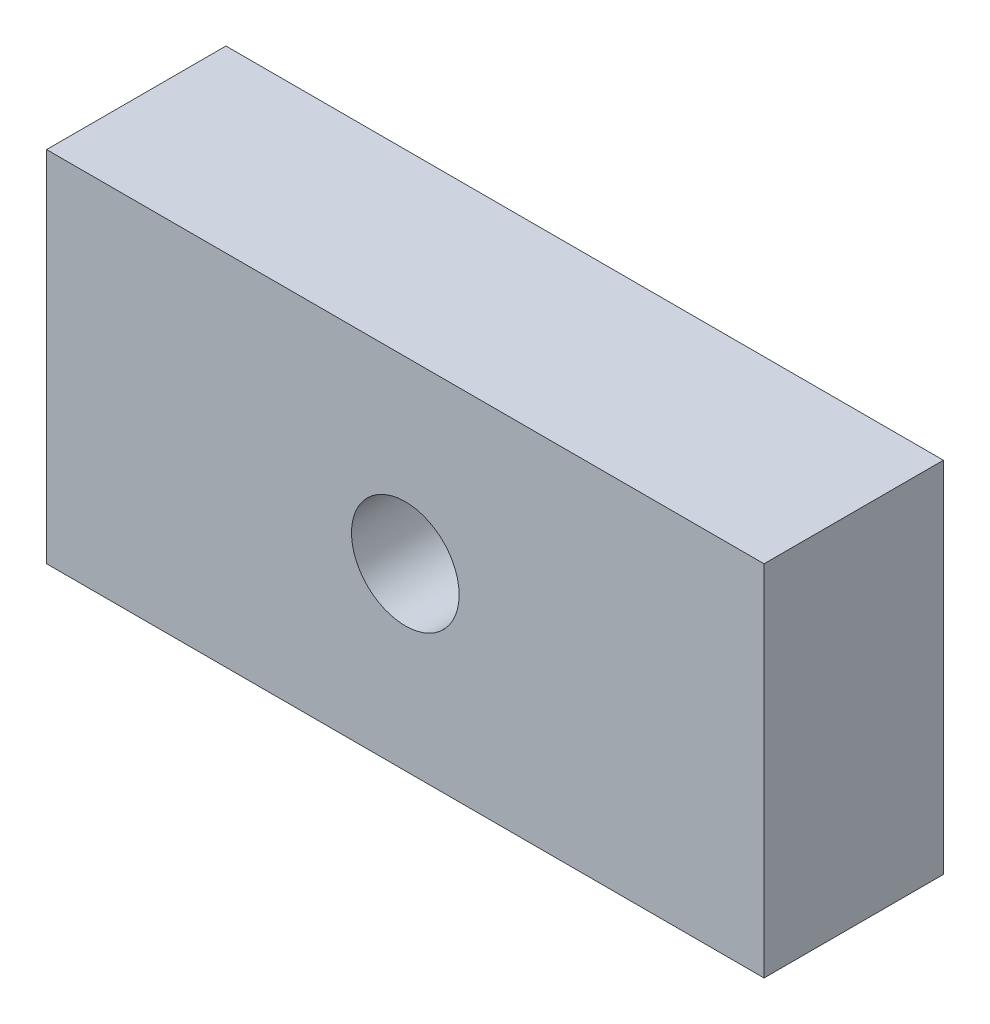
ISO-10303-21;
HEADER;
FILE_DESCRIPTION(('STEP AP214'),'2;1');
FILE_NAME('part.step','',(''),(''),'','','');
FILE_SCHEMA(('AUTOMOTIVE_DESIGN { 1 0 10303 214 1 1 1 1 }'));
ENDSEC;
DATA;
#1=APPLICATION_CONTEXT('core data for automotive mechanical design processes');
#2=APPLICATION_PROTOCOL_DEFINITION('international standard','automotive_design',2000,#1);
#3=PRODUCT_CONTEXT('',#1,'mechanical');
#4=PRODUCT('Part','Part','',(#3));
#5=PRODUCT_RELATED_PRODUCT_CATEGORY('part','',(#4));
#6=PRODUCT_DEFINITION_FORMATION('','',#4);
#7=PRODUCT_DEFINITION_CONTEXT('part definition',#1,'design');
#8=PRODUCT_DEFINITION('design','',#6,#7);
#9=PRODUCT_DEFINITION_SHAPE('','',#8);
#10=(LENGTH_UNIT() NAMED_UNIT(*) SI_UNIT(.MILLI.,.METRE.));
#11=(NAMED_UNIT(*) PLANE_ANGLE_UNIT() SI_UNIT($,.RADIAN.));
#12=(NAMED_UNIT(*) SI_UNIT($,.STERADIAN.) SOLID_ANGLE_UNIT());
#13=UNCERTAINTY_MEASURE_WITH_UNIT(LENGTH_MEASURE(1.E-05),#10,'distance_accuracy_value','');
#14=(GEOMETRIC_REPRESENTATION_CONTEXT(3) GLOBAL_UNCERTAINTY_ASSIGNED_CONTEXT((#13)) GLOBAL_UNIT_ASSIGNED_CONTEXT((#10,
#11,#12)) REPRESENTATION_CONTEXT('',''));
#15=CARTESIAN_POINT('',(0.,0.,0.));
#16=DIRECTION('',(0.,0.,1.));
#17=DIRECTION('',(1.,0.,0.));
#18=AXIS2_PLACEMENT_3D('',#15,#16,#17);
#19=CARTESIAN_POINT('',(50.,25.,25.));
#20=DIRECTION('',(-1.,0.,0.));
#21=DIRECTION('',(0.,-1.,0.));
#22=AXIS2_PLACEMENT_3D('',#19,#20,#21);
#23=PLANE('',#22);
#24=DIRECTION('',(0.,1.,0.));
#25=VECTOR('',#24,1.);
#26=CARTESIAN_POINT('',(50.,25.,0.));
#27=LINE('',#26,#25);
#28=CARTESIAN_POINT('',(50.,-25.,0.));
#29=VERTEX_POINT('',#28);
#30=CARTESIAN_POINT('',(50.,25.,0.));
#31=VERTEX_POINT('',#30);
#32=EDGE_CURVE('E97',#29,#31,#27,.T.);
#33=ORIENTED_EDGE('',*,*,#32,.T.);
#34=DIRECTION('',(0.,0.,-1.));
#35=VECTOR('',#34,1.);
#36=CARTESIAN_POINT('',(50.,25.,25.));
#37=LINE('',#36,#35);
#38=CARTESIAN_POINT('',(50.,25.,25.));
#39=VERTEX_POINT('',#38);
#40=EDGE_CURVE('E11',#39,#31,#37,.T.);
#41=ORIENTED_EDGE('',*,*,#40,.F.);
#42=DIRECTION('',(0.,1.,0.));
#43=VECTOR('',#42,1.);
#44=CARTESIAN_POINT('',(50.,25.,25.));
#45=LINE('',#44,#43);
#46=CARTESIAN_POINT('',(50.,-25.,25.));
#47=VERTEX_POINT('',#46);
#48=EDGE_CURVE('E85',#47,#39,#45,.T.);
#49=ORIENTED_EDGE('',*,*,#48,.F.);
#50=DIRECTION('',(0.,0.,-1.));
#51=VECTOR('',#50,1.);
#52=CARTESIAN_POINT('',(50.,-25.,25.));
#53=LINE('',#52,#51);
#54=EDGE_CURVE('E93',#47,#29,#53,.T.);
#55=ORIENTED_EDGE('',*,*,#54,.T.);
#56=EDGE_LOOP('',(#33,#41,#49,#55));
#57=FACE_BOUND('',#56,.T.);
#58=ADVANCED_FACE('F34',(#57),#23,.F.);
#59=CARTESIAN_POINT('',(-50.,25.,25.));
#60=DIRECTION('',(0.,-1.,0.));
#61=DIRECTION('',(0.,0.,-1.));
#62=AXIS2_PLACEMENT_3D('',#59,#60,#61);
#63=PLANE('',#62);
#64=DIRECTION('',(-1.,0.,0.));
#65=VECTOR('',#64,1.);
#66=CARTESIAN_POINT('',(-50.,25.,0.));
#67=LINE('',#66,#65);
#68=CARTESIAN_POINT('',(-50.,25.,0.));
#69=VERTEX_POINT('',#68);
#70=EDGE_CURVE('E89',#31,#69,#67,.T.);
#71=ORIENTED_EDGE('',*,*,#70,.T.);
#72=DIRECTION('',(0.,0.,-1.));
#73=VECTOR('',#72,1.);
#74=CARTESIAN_POINT('',(-50.,25.,25.));
#75=LINE('',#74,#73);
#76=CARTESIAN_POINT('',(-50.,25.,25.));
#77=VERTEX_POINT('',#76);
#78=EDGE_CURVE('E42',#77,#69,#75,.T.);
#79=ORIENTED_EDGE('',*,*,#78,.F.);
#80=DIRECTION('',(-1.,0.,0.));
#81=VECTOR('',#80,1.);
#82=CARTESIAN_POINT('',(-50.,25.,25.));
#83=LINE('',#82,#81);
#84=EDGE_CURVE('E80',#39,#77,#83,.T.);
#85=ORIENTED_EDGE('',*,*,#84,.F.);
#86=ORIENTED_EDGE('',*,*,#40,.T.);
#87=EDGE_LOOP('',(#71,#79,#85,#86));
#88=FACE_BOUND('',#87,.T.);
#89=ADVANCED_FACE('F88',(#88),#63,.F.);
#90=CARTESIAN_POINT('',(-50.,25.,25.));
#91=DIRECTION('',(1.,0.,0.));
#92=DIRECTION('',(0.,1.,0.));
#93=AXIS2_PLACEMENT_3D('',#90,#91,#92);
#94=PLANE('',#93);
#95=DIRECTION('',(0.,-1.,0.));
#96=VECTOR('',#95,1.);
#97=CARTESIAN_POINT('',(-50.,25.,0.));
#98=LINE('',#97,#96);
#99=CARTESIAN_POINT('',(-50.,-25.,0.));
#100=VERTEX_POINT('',#99);
#101=EDGE_CURVE('E67',#69,#100,#98,.T.);
#102=ORIENTED_EDGE('',*,*,#101,.T.);
#103=DIRECTION('',(0.,0.,-1.));
#104=VECTOR('',#103,1.);
#105=CARTESIAN_POINT('',(-50.,-25.,25.));
#106=LINE('',#105,#104);
#107=CARTESIAN_POINT('',(-50.,-25.,25.));
#108=VERTEX_POINT('',#107);
#109=EDGE_CURVE('E90',#108,#100,#106,.T.);
#110=ORIENTED_EDGE('',*,*,#109,.F.);
#111=DIRECTION('',(0.,-1.,0.));
#112=VECTOR('',#111,1.);
#113=CARTESIAN_POINT('',(-50.,25.,25.));
#114=LINE('',#113,#112);
#115=EDGE_CURVE('E83',#77,#108,#114,.T.);
#116=ORIENTED_EDGE('',*,*,#115,.F.);
#117=ORIENTED_EDGE('',*,*,#78,.T.);
#118=EDGE_LOOP('',(#102,#110,#116,#117));
#119=FACE_BOUND('',#118,.T.);
#120=ADVANCED_FACE('F91',(#119),#94,.F.);
#121=CARTESIAN_POINT('',(-50.,-25.,25.));
#122=DIRECTION('',(0.,1.,0.));
#123=DIRECTION('',(0.,0.,1.));
#124=AXIS2_PLACEMENT_3D('',#121,#122,#123);
#125=PLANE('',#124);
#126=DIRECTION('',(1.,0.,0.));
#127=VECTOR('',#126,1.);
#128=CARTESIAN_POINT('',(-50.,-25.,0.));
#129=LINE('',#128,#127);
#130=EDGE_CURVE('E73',#100,#29,#129,.T.);
#131=ORIENTED_EDGE('',*,*,#130,.T.);
#132=ORIENTED_EDGE('',*,*,#54,.F.);
#133=DIRECTION('',(1.,0.,0.));
#134=VECTOR('',#133,1.);
#135=CARTESIAN_POINT('',(-50.,-25.,25.));
#136=LINE('',#135,#134);
#137=EDGE_CURVE('E50',#108,#47,#136,.T.);
#138=ORIENTED_EDGE('',*,*,#137,.F.);
#139=ORIENTED_EDGE('',*,*,#109,.T.);
#140=EDGE_LOOP('',(#131,#132,#138,#139));
#141=FACE_BOUND('',#140,.T.);
#142=ADVANCED_FACE('F105',(#141),#125,.F.);
#143=CARTESIAN_POINT('',(0.,0.,25.));
#144=DIRECTION('',(0.,0.,1.));
#145=DIRECTION('',(1.,0.,0.));
#146=AXIS2_PLACEMENT_3D('',#143,#144,#145);
#147=PLANE('',#146);
#148=CARTESIAN_POINT('',(0.,0.,25.));
#149=DIRECTION('',(0.,0.,1.));
#150=DIRECTION('',(1.,0.,0.));
#151=AXIS2_PLACEMENT_3D('',#148,#149,#150);
#152=CIRCLE('',#151,7.5);
#153=CARTESIAN_POINT('',(7.5,0.,25.));
#154=VERTEX_POINT('',#153);
#155=EDGE_CURVE('E113',#154,#154,#152,.T.);
#156=ORIENTED_EDGE('',*,*,#155,.F.);
#157=EDGE_LOOP('',(#156));
#158=FACE_BOUND('',#157,.T.);
#159=ORIENTED_EDGE('',*,*,#48,.T.);
#160=ORIENTED_EDGE('',*,*,#84,.T.);
#161=ORIENTED_EDGE('',*,*,#115,.T.);
#162=ORIENTED_EDGE('',*,*,#137,.T.);
#163=EDGE_LOOP('',(#159,#160,#161,#162));
#164=FACE_BOUND('',#163,.T.);
#165=ADVANCED_FACE('F81',(#158,#164),#147,.T.);
#166=CARTESIAN_POINT('',(0.,0.,0.));
#167=DIRECTION('',(0.,0.,1.));
#168=DIRECTION('',(1.,0.,0.));
#169=AXIS2_PLACEMENT_3D('',#166,#167,#168);
#170=PLANE('',#169);
#171=CARTESIAN_POINT('',(0.,0.,0.));
#172=DIRECTION('',(0.,0.,1.));
#173=DIRECTION('',(1.,0.,0.));
#174=AXIS2_PLACEMENT_3D('',#171,#172,#173);
#175=CIRCLE('',#174,7.5);
#176=CARTESIAN_POINT('',(7.5,0.,0.));
#177=VERTEX_POINT('',#176);
#178=EDGE_CURVE('E100',#177,#177,#175,.F.);
#179=ORIENTED_EDGE('',*,*,#178,.F.);
#180=EDGE_LOOP('',(#179));
#181=FACE_BOUND('',#180,.T.);
#182=ORIENTED_EDGE('',*,*,#32,.F.);
#183=ORIENTED_EDGE('',*,*,#130,.F.);
#184=ORIENTED_EDGE('',*,*,#101,.F.);
#185=ORIENTED_EDGE('',*,*,#70,.F.);
#186=EDGE_LOOP('',(#182,#183,#184,#185));
#187=FACE_BOUND('',#186,.T.);
#188=ADVANCED_FACE('F108',(#181,#187),#170,.F.);
#189=CARTESIAN_POINT('',(0.,0.,-0.001000000000001));
#190=DIRECTION('',(0.,0.,1.));
#191=DIRECTION('',(1.,0.,0.));
#192=AXIS2_PLACEMENT_3D('',#189,#190,#191);
#193=CYLINDRICAL_SURFACE('',#192,7.5);
#194=ORIENTED_EDGE('',*,*,#155,.T.);
#195=EDGE_LOOP('',(#194));
#196=FACE_BOUND('',#195,.T.);
#197=ORIENTED_EDGE('',*,*,#178,.T.);
#198=EDGE_LOOP('',(#197));
#199=FACE_BOUND('',#198,.T.);
#200=ADVANCED_FACE('F117',(#196,#199),#193,.F.);
#201=CLOSED_SHELL('',(#58,#89,#120,#142,#165,#188,#200));
#202=MANIFOLD_SOLID_BREP('B2',#201);
#203=ADVANCED_BREP_SHAPE_REPRESENTATION('',(#18,#202),#14);
#204=SHAPE_DEFINITION_REPRESENTATION(#9,#203);
ENDSEC;
END-ISO-10303-21;
